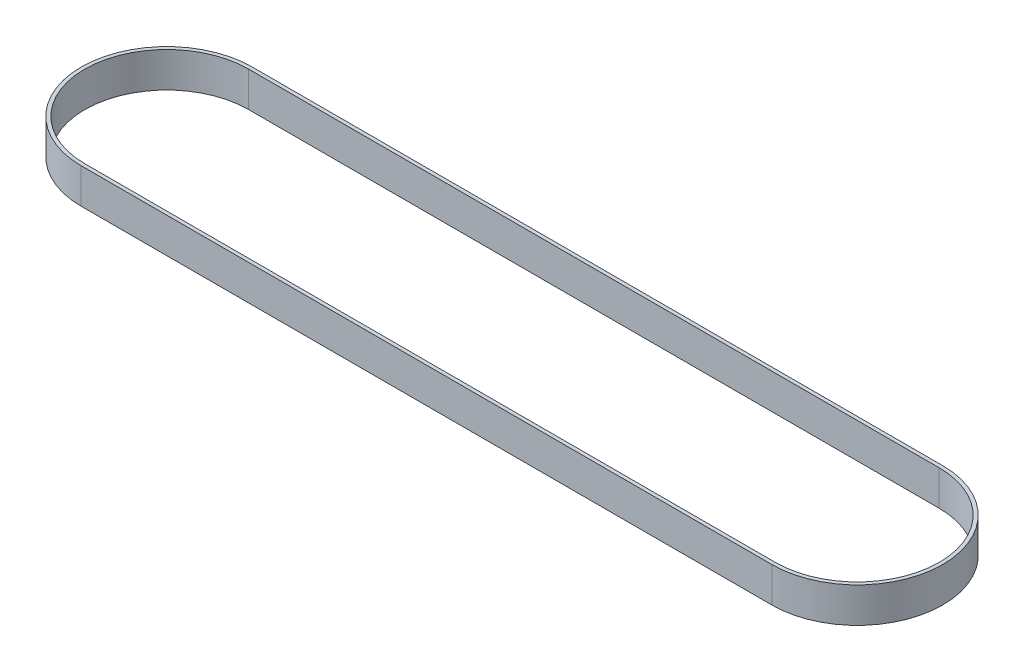
ISO-10303-21;
HEADER;
FILE_DESCRIPTION(('STEP AP214'),'2;1');
FILE_NAME('part.step','',(''),(''),'','','');
FILE_SCHEMA(('AUTOMOTIVE_DESIGN { 1 0 10303 214 1 1 1 1 }'));
ENDSEC;
DATA;
#1=APPLICATION_CONTEXT('core data for automotive mechanical design processes');
#2=APPLICATION_PROTOCOL_DEFINITION('international standard','automotive_design',2000,#1);
#3=PRODUCT_CONTEXT('',#1,'mechanical');
#4=PRODUCT('Part','Part','',(#3));
#5=PRODUCT_RELATED_PRODUCT_CATEGORY('part','',(#4));
#6=PRODUCT_DEFINITION_FORMATION('','',#4);
#7=PRODUCT_DEFINITION_CONTEXT('part definition',#1,'design');
#8=PRODUCT_DEFINITION('design','',#6,#7);
#9=PRODUCT_DEFINITION_SHAPE('','',#8);
#10=(LENGTH_UNIT() NAMED_UNIT(*) SI_UNIT(.MILLI.,.METRE.));
#11=(NAMED_UNIT(*) PLANE_ANGLE_UNIT() SI_UNIT($,.RADIAN.));
#12=(NAMED_UNIT(*) SI_UNIT($,.STERADIAN.) SOLID_ANGLE_UNIT());
#13=UNCERTAINTY_MEASURE_WITH_UNIT(LENGTH_MEASURE(1.E-05),#10,'distance_accuracy_value','');
#14=(GEOMETRIC_REPRESENTATION_CONTEXT(3) GLOBAL_UNCERTAINTY_ASSIGNED_CONTEXT((#13)) GLOBAL_UNIT_ASSIGNED_CONTEXT((#10,
#11,#12)) REPRESENTATION_CONTEXT('',''));
#15=CARTESIAN_POINT('',(0.,0.,0.));
#16=DIRECTION('',(0.,0.,1.));
#17=DIRECTION('',(1.,0.,0.));
#18=AXIS2_PLACEMENT_3D('',#15,#16,#17);
#19=CARTESIAN_POINT('',(0.,15.,-36.5379));
#20=DIRECTION('',(0.,0.,1.));
#21=DIRECTION('',(1.,0.,0.));
#22=AXIS2_PLACEMENT_3D('',#19,#20,#21);
#23=PLANE('',#22);
#24=DIRECTION('',(0.,-1.,0.));
#25=VECTOR('',#24,1.);
#26=CARTESIAN_POINT('',(0.,15.,-36.5379));
#27=LINE('',#26,#25);
#28=CARTESIAN_POINT('',(0.,15.,-36.5379));
#29=VERTEX_POINT('',#28);
#30=CARTESIAN_POINT('',(0.,0.,-36.5379));
#31=VERTEX_POINT('',#30);
#32=EDGE_CURVE('E79',#29,#31,#27,.T.);
#33=ORIENTED_EDGE('',*,*,#32,.F.);
#34=DIRECTION('',(1.,0.,0.));
#35=VECTOR('',#34,1.);
#36=CARTESIAN_POINT('',(0.,15.,-36.5379));
#37=LINE('',#36,#35);
#38=CARTESIAN_POINT('',(295.0718,15.,-36.5379));
#39=VERTEX_POINT('',#38);
#40=EDGE_CURVE('E81',#39,#29,#37,.F.);
#41=ORIENTED_EDGE('',*,*,#40,.F.);
#42=DIRECTION('',(0.,-1.,0.));
#43=VECTOR('',#42,1.);
#44=CARTESIAN_POINT('',(295.0718,15.,-36.5379));
#45=LINE('',#44,#43);
#46=CARTESIAN_POINT('',(295.0718,0.,-36.5379));
#47=VERTEX_POINT('',#46);
#48=EDGE_CURVE('E132',#47,#39,#45,.F.);
#49=ORIENTED_EDGE('',*,*,#48,.F.);
#50=DIRECTION('',(1.,0.,0.));
#51=VECTOR('',#50,1.);
#52=CARTESIAN_POINT('',(0.,0.,-36.5379));
#53=LINE('',#52,#51);
#54=EDGE_CURVE('E83',#47,#31,#53,.F.);
#55=ORIENTED_EDGE('',*,*,#54,.T.);
#56=EDGE_LOOP('',(#33,#41,#49,#55));
#57=FACE_BOUND('',#56,.T.);
#58=ADVANCED_FACE('F16',(#57),#23,.F.);
#59=CARTESIAN_POINT('',(0.,15.,-35.0139));
#60=DIRECTION('',(0.,0.,1.));
#61=DIRECTION('',(1.,0.,0.));
#62=AXIS2_PLACEMENT_3D('',#59,#60,#61);
#63=PLANE('',#62);
#64=DIRECTION('',(1.,0.,0.));
#65=VECTOR('',#64,1.);
#66=CARTESIAN_POINT('',(0.,15.,-35.0139));
#67=LINE('',#66,#65);
#68=CARTESIAN_POINT('',(0.,15.,-35.0139));
#69=VERTEX_POINT('',#68);
#70=CARTESIAN_POINT('',(295.0718,15.,-35.0139));
#71=VERTEX_POINT('',#70);
#72=EDGE_CURVE('E138',#69,#71,#67,.T.);
#73=ORIENTED_EDGE('',*,*,#72,.F.);
#74=DIRECTION('',(0.,-1.,0.));
#75=VECTOR('',#74,1.);
#76=CARTESIAN_POINT('',(0.,15.,-35.0139));
#77=LINE('',#76,#75);
#78=CARTESIAN_POINT('',(0.,0.,-35.0139));
#79=VERTEX_POINT('',#78);
#80=EDGE_CURVE('E89',#69,#79,#77,.T.);
#81=ORIENTED_EDGE('',*,*,#80,.T.);
#82=DIRECTION('',(1.,0.,0.));
#83=VECTOR('',#82,1.);
#84=CARTESIAN_POINT('',(0.,0.,-35.0139));
#85=LINE('',#84,#83);
#86=CARTESIAN_POINT('',(295.0718,0.,-35.0139));
#87=VERTEX_POINT('',#86);
#88=EDGE_CURVE('E123',#79,#87,#85,.T.);
#89=ORIENTED_EDGE('',*,*,#88,.T.);
#90=DIRECTION('',(0.,-1.,0.));
#91=VECTOR('',#90,1.);
#92=CARTESIAN_POINT('',(295.0718,15.,-35.0139));
#93=LINE('',#92,#91);
#94=EDGE_CURVE('E127',#87,#71,#93,.F.);
#95=ORIENTED_EDGE('',*,*,#94,.T.);
#96=EDGE_LOOP('',(#73,#81,#89,#95));
#97=FACE_BOUND('',#96,.T.);
#98=ADVANCED_FACE('F176',(#97),#63,.T.);
#99=CARTESIAN_POINT('',(295.0718,15.,0.));
#100=DIRECTION('',(0.,-1.,0.));
#101=DIRECTION('',(0.,0.,-1.));
#102=AXIS2_PLACEMENT_3D('',#99,#100,#101);
#103=CYLINDRICAL_SURFACE('',#102,35.0139);
#104=DIRECTION('',(0.,1.,0.));
#105=VECTOR('',#104,1.);
#106=CARTESIAN_POINT('',(295.0718,15.,35.0139));
#107=LINE('',#106,#105);
#108=CARTESIAN_POINT('',(295.0718,15.,35.0139));
#109=VERTEX_POINT('',#108);
#110=CARTESIAN_POINT('',(295.0718,0.,35.0139));
#111=VERTEX_POINT('',#110);
#112=EDGE_CURVE('E130',#109,#111,#107,.F.);
#113=ORIENTED_EDGE('',*,*,#112,.F.);
#114=CARTESIAN_POINT('',(295.0718,15.,0.));
#115=DIRECTION('',(0.,-1.,0.));
#116=DIRECTION('',(0.,0.,-1.));
#117=AXIS2_PLACEMENT_3D('',#114,#115,#116);
#118=CIRCLE('',#117,35.0139);
#119=EDGE_CURVE('E134',#71,#109,#118,.T.);
#120=ORIENTED_EDGE('',*,*,#119,.F.);
#121=ORIENTED_EDGE('',*,*,#94,.F.);
#122=CARTESIAN_POINT('',(295.0718,0.,0.));
#123=DIRECTION('',(0.,-1.,0.));
#124=DIRECTION('',(0.,0.,-1.));
#125=AXIS2_PLACEMENT_3D('',#122,#123,#124);
#126=CIRCLE('',#125,35.0139);
#127=EDGE_CURVE('E113',#87,#111,#126,.T.);
#128=ORIENTED_EDGE('',*,*,#127,.T.);
#129=EDGE_LOOP('',(#113,#120,#121,#128));
#130=FACE_BOUND('',#129,.T.);
#131=ADVANCED_FACE('F195',(#130),#103,.F.);
#132=CARTESIAN_POINT('',(0.,15.,35.0139));
#133=DIRECTION('',(0.,0.,-1.));
#134=DIRECTION('',(-1.,0.,0.));
#135=AXIS2_PLACEMENT_3D('',#132,#133,#134);
#136=PLANE('',#135);
#137=DIRECTION('',(1.,0.,0.));
#138=VECTOR('',#137,1.);
#139=CARTESIAN_POINT('',(0.,15.,35.0139));
#140=LINE('',#139,#138);
#141=CARTESIAN_POINT('',(0.,15.,35.0139));
#142=VERTEX_POINT('',#141);
#143=EDGE_CURVE('E98',#109,#142,#140,.F.);
#144=ORIENTED_EDGE('',*,*,#143,.F.);
#145=ORIENTED_EDGE('',*,*,#112,.T.);
#146=DIRECTION('',(1.,0.,0.));
#147=VECTOR('',#146,1.);
#148=CARTESIAN_POINT('',(0.,0.,35.0139));
#149=LINE('',#148,#147);
#150=CARTESIAN_POINT('',(0.,0.,35.0139));
#151=VERTEX_POINT('',#150);
#152=EDGE_CURVE('E109',#111,#151,#149,.F.);
#153=ORIENTED_EDGE('',*,*,#152,.T.);
#154=DIRECTION('',(0.,-1.,0.));
#155=VECTOR('',#154,1.);
#156=CARTESIAN_POINT('',(0.,15.,35.0139));
#157=LINE('',#156,#155);
#158=EDGE_CURVE('E142',#151,#142,#157,.F.);
#159=ORIENTED_EDGE('',*,*,#158,.T.);
#160=EDGE_LOOP('',(#144,#145,#153,#159));
#161=FACE_BOUND('',#160,.T.);
#162=ADVANCED_FACE('F191',(#161),#136,.T.);
#163=CARTESIAN_POINT('',(0.,15.,0.));
#164=DIRECTION('',(0.,-1.,0.));
#165=DIRECTION('',(0.,0.,-1.));
#166=AXIS2_PLACEMENT_3D('',#163,#164,#165);
#167=CYLINDRICAL_SURFACE('',#166,35.0139);
#168=ORIENTED_EDGE('',*,*,#80,.F.);
#169=CARTESIAN_POINT('',(0.,15.,0.));
#170=DIRECTION('',(0.,-1.,0.));
#171=DIRECTION('',(0.,0.,-1.));
#172=AXIS2_PLACEMENT_3D('',#169,#170,#171);
#173=CIRCLE('',#172,35.0139);
#174=EDGE_CURVE('E119',#142,#69,#173,.T.);
#175=ORIENTED_EDGE('',*,*,#174,.F.);
#176=ORIENTED_EDGE('',*,*,#158,.F.);
#177=CARTESIAN_POINT('',(0.,0.,0.));
#178=DIRECTION('',(0.,-1.,0.));
#179=DIRECTION('',(0.,0.,-1.));
#180=AXIS2_PLACEMENT_3D('',#177,#178,#179);
#181=CIRCLE('',#180,35.0139);
#182=EDGE_CURVE('E112',#151,#79,#181,.T.);
#183=ORIENTED_EDGE('',*,*,#182,.T.);
#184=EDGE_LOOP('',(#168,#175,#176,#183));
#185=FACE_BOUND('',#184,.T.);
#186=ADVANCED_FACE('F184',(#185),#167,.F.);
#187=CARTESIAN_POINT('',(0.,15.,0.));
#188=DIRECTION('',(0.,-1.,0.));
#189=DIRECTION('',(0.,0.,-1.));
#190=AXIS2_PLACEMENT_3D('',#187,#188,#189);
#191=CYLINDRICAL_SURFACE('',#190,36.5379);
#192=CARTESIAN_POINT('',(0.,15.,0.));
#193=DIRECTION('',(0.,-1.,0.));
#194=DIRECTION('',(0.,0.,-1.));
#195=AXIS2_PLACEMENT_3D('',#192,#193,#194);
#196=CIRCLE('',#195,36.5379);
#197=CARTESIAN_POINT('',(0.,15.,36.5379));
#198=VERTEX_POINT('',#197);
#199=EDGE_CURVE('E19',#29,#198,#196,.F.);
#200=ORIENTED_EDGE('',*,*,#199,.F.);
#201=ORIENTED_EDGE('',*,*,#32,.T.);
#202=CARTESIAN_POINT('',(0.,0.,0.));
#203=DIRECTION('',(0.,-1.,0.));
#204=DIRECTION('',(0.,0.,-1.));
#205=AXIS2_PLACEMENT_3D('',#202,#203,#204);
#206=CIRCLE('',#205,36.5379);
#207=CARTESIAN_POINT('',(0.,0.,36.5379));
#208=VERTEX_POINT('',#207);
#209=EDGE_CURVE('E162',#31,#208,#206,.F.);
#210=ORIENTED_EDGE('',*,*,#209,.T.);
#211=DIRECTION('',(0.,1.,0.));
#212=VECTOR('',#211,1.);
#213=CARTESIAN_POINT('',(0.,15.,36.5379));
#214=LINE('',#213,#212);
#215=EDGE_CURVE('E103',#208,#198,#214,.T.);
#216=ORIENTED_EDGE('',*,*,#215,.T.);
#217=EDGE_LOOP('',(#200,#201,#210,#216));
#218=FACE_BOUND('',#217,.T.);
#219=ADVANCED_FACE('F101',(#218),#191,.T.);
#220=CARTESIAN_POINT('',(0.,15.,0.));
#221=DIRECTION('',(0.,1.,0.));
#222=DIRECTION('',(0.,0.,1.));
#223=AXIS2_PLACEMENT_3D('',#220,#221,#222);
#224=PLANE('',#223);
#225=ORIENTED_EDGE('',*,*,#72,.T.);
#226=ORIENTED_EDGE('',*,*,#119,.T.);
#227=ORIENTED_EDGE('',*,*,#143,.T.);
#228=ORIENTED_EDGE('',*,*,#174,.T.);
#229=EDGE_LOOP('',(#225,#226,#227,#228));
#230=FACE_BOUND('',#229,.T.);
#231=CARTESIAN_POINT('',(295.0718,15.,0.));
#232=DIRECTION('',(0.,-1.,0.));
#233=DIRECTION('',(0.,0.,-1.));
#234=AXIS2_PLACEMENT_3D('',#231,#232,#233);
#235=CIRCLE('',#234,36.5379);
#236=CARTESIAN_POINT('',(295.0718,15.,36.5379));
#237=VERTEX_POINT('',#236);
#238=EDGE_CURVE('E96',#39,#237,#235,.T.);
#239=ORIENTED_EDGE('',*,*,#238,.F.);
#240=ORIENTED_EDGE('',*,*,#40,.T.);
#241=ORIENTED_EDGE('',*,*,#199,.T.);
#242=DIRECTION('',(-1.,0.,0.));
#243=VECTOR('',#242,1.);
#244=CARTESIAN_POINT('',(0.,15.,36.5379));
#245=LINE('',#244,#243);
#246=EDGE_CURVE('E115',#198,#237,#245,.F.);
#247=ORIENTED_EDGE('',*,*,#246,.T.);
#248=EDGE_LOOP('',(#239,#240,#241,#247));
#249=FACE_BOUND('',#248,.T.);
#250=ADVANCED_FACE('F93',(#230,#249),#224,.T.);
#251=CARTESIAN_POINT('',(295.0718,15.,0.));
#252=DIRECTION('',(0.,-1.,0.));
#253=DIRECTION('',(0.,0.,-1.));
#254=AXIS2_PLACEMENT_3D('',#251,#252,#253);
#255=CYLINDRICAL_SURFACE('',#254,36.5379);
#256=ORIENTED_EDGE('',*,*,#238,.T.);
#257=DIRECTION('',(0.,1.,0.));
#258=VECTOR('',#257,1.);
#259=CARTESIAN_POINT('',(295.0718,15.,36.5379));
#260=LINE('',#259,#258);
#261=CARTESIAN_POINT('',(295.0718,0.,36.5379));
#262=VERTEX_POINT('',#261);
#263=EDGE_CURVE('E26',#237,#262,#260,.F.);
#264=ORIENTED_EDGE('',*,*,#263,.T.);
#265=CARTESIAN_POINT('',(295.0718,0.,0.));
#266=DIRECTION('',(0.,-1.,0.));
#267=DIRECTION('',(0.,0.,-1.));
#268=AXIS2_PLACEMENT_3D('',#265,#266,#267);
#269=CIRCLE('',#268,36.5379);
#270=EDGE_CURVE('E38',#262,#47,#269,.F.);
#271=ORIENTED_EDGE('',*,*,#270,.T.);
#272=ORIENTED_EDGE('',*,*,#48,.T.);
#273=EDGE_LOOP('',(#256,#264,#271,#272));
#274=FACE_BOUND('',#273,.T.);
#275=ADVANCED_FACE('F206',(#274),#255,.T.);
#276=CARTESIAN_POINT('',(0.,0.,0.));
#277=DIRECTION('',(0.,1.,0.));
#278=DIRECTION('',(0.,0.,1.));
#279=AXIS2_PLACEMENT_3D('',#276,#277,#278);
#280=PLANE('',#279);
#281=ORIENTED_EDGE('',*,*,#152,.F.);
#282=ORIENTED_EDGE('',*,*,#127,.F.);
#283=ORIENTED_EDGE('',*,*,#88,.F.);
#284=ORIENTED_EDGE('',*,*,#182,.F.);
#285=EDGE_LOOP('',(#281,#282,#283,#284));
#286=FACE_BOUND('',#285,.T.);
#287=ORIENTED_EDGE('',*,*,#54,.F.);
#288=ORIENTED_EDGE('',*,*,#270,.F.);
#289=DIRECTION('',(-1.,0.,0.));
#290=VECTOR('',#289,1.);
#291=CARTESIAN_POINT('',(0.,0.,36.5379));
#292=LINE('',#291,#290);
#293=EDGE_CURVE('E11',#262,#208,#292,.T.);
#294=ORIENTED_EDGE('',*,*,#293,.T.);
#295=ORIENTED_EDGE('',*,*,#209,.F.);
#296=EDGE_LOOP('',(#287,#288,#294,#295));
#297=FACE_BOUND('',#296,.T.);
#298=ADVANCED_FACE('F187',(#286,#297),#280,.F.);
#299=CARTESIAN_POINT('',(0.,15.,36.5379));
#300=DIRECTION('',(0.,0.,-1.));
#301=DIRECTION('',(-1.,0.,0.));
#302=AXIS2_PLACEMENT_3D('',#299,#300,#301);
#303=PLANE('',#302);
#304=ORIENTED_EDGE('',*,*,#263,.F.);
#305=ORIENTED_EDGE('',*,*,#246,.F.);
#306=ORIENTED_EDGE('',*,*,#215,.F.);
#307=ORIENTED_EDGE('',*,*,#293,.F.);
#308=EDGE_LOOP('',(#304,#305,#306,#307));
#309=FACE_BOUND('',#308,.T.);
#310=ADVANCED_FACE('F204',(#309),#303,.F.);
#311=CLOSED_SHELL('',(#58,#98,#131,#162,#186,#219,#250,#275,#298,#310));
#312=MANIFOLD_SOLID_BREP('B1',#311);
#313=ADVANCED_BREP_SHAPE_REPRESENTATION('',(#18,#312),#14);
#314=SHAPE_DEFINITION_REPRESENTATION(#9,#313);
ENDSEC;
END-ISO-10303-21;
